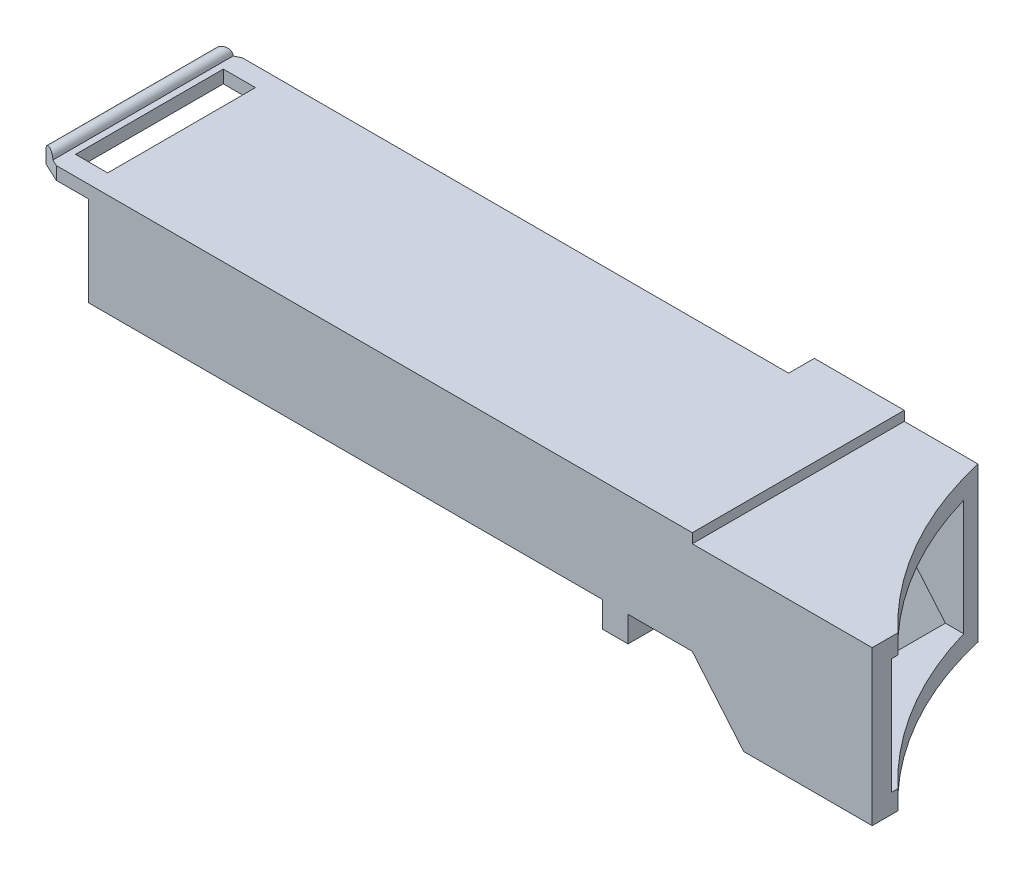
ISO-10303-21;
HEADER;
FILE_DESCRIPTION(('STEP AP214'),'2;1');
FILE_NAME('part.step','',(''),(''),'','','');
FILE_SCHEMA(('AUTOMOTIVE_DESIGN { 1 0 10303 214 1 1 1 1 }'));
ENDSEC;
DATA;
#1=APPLICATION_CONTEXT('core data for automotive mechanical design processes');
#2=APPLICATION_PROTOCOL_DEFINITION('international standard','automotive_design',2000,#1);
#3=PRODUCT_CONTEXT('',#1,'mechanical');
#4=PRODUCT('Part','Part','',(#3));
#5=PRODUCT_RELATED_PRODUCT_CATEGORY('part','',(#4));
#6=PRODUCT_DEFINITION_FORMATION('','',#4);
#7=PRODUCT_DEFINITION_CONTEXT('part definition',#1,'design');
#8=PRODUCT_DEFINITION('design','',#6,#7);
#9=PRODUCT_DEFINITION_SHAPE('','',#8);
#10=(LENGTH_UNIT() NAMED_UNIT(*) SI_UNIT(.MILLI.,.METRE.));
#11=(NAMED_UNIT(*) PLANE_ANGLE_UNIT() SI_UNIT($,.RADIAN.));
#12=(NAMED_UNIT(*) SI_UNIT($,.STERADIAN.) SOLID_ANGLE_UNIT());
#13=UNCERTAINTY_MEASURE_WITH_UNIT(LENGTH_MEASURE(1.E-05),#10,'distance_accuracy_value','');
#14=(GEOMETRIC_REPRESENTATION_CONTEXT(3) GLOBAL_UNCERTAINTY_ASSIGNED_CONTEXT((#13)) GLOBAL_UNIT_ASSIGNED_CONTEXT((#10,
#11,#12)) REPRESENTATION_CONTEXT('',''));
#15=CARTESIAN_POINT('',(0.,0.,0.));
#16=DIRECTION('',(0.,0.,1.));
#17=DIRECTION('',(1.,0.,0.));
#18=AXIS2_PLACEMENT_3D('',#15,#16,#17);
#19=CARTESIAN_POINT('',(70.,-8.,16.5));
#20=DIRECTION('',(0.,1.,0.));
#21=DIRECTION('',(-1.,0.,0.));
#22=AXIS2_PLACEMENT_3D('',#19,#20,#21);
#23=PLANE('',#22);
#24=DIRECTION('',(1.,0.,0.));
#25=VECTOR('',#24,1.);
#26=CARTESIAN_POINT('',(70.,-8.,1.99999999999991));
#27=LINE('',#26,#25);
#28=CARTESIAN_POINT('',(23.,-8.,1.99999999999994));
#29=VERTEX_POINT('',#28);
#30=CARTESIAN_POINT('',(63.,-8.,1.99999999999991));
#31=VERTEX_POINT('',#30);
#32=EDGE_CURVE('E273',#29,#31,#27,.T.);
#33=ORIENTED_EDGE('',*,*,#32,.T.);
#34=DIRECTION('',(0.,0.,-1.));
#35=VECTOR('',#34,1.);
#36=CARTESIAN_POINT('',(63.,-8.,1.99999999999991));
#37=LINE('',#36,#35);
#38=CARTESIAN_POINT('',(63.,-8.,0.));
#39=VERTEX_POINT('',#38);
#40=EDGE_CURVE('E278',#31,#39,#37,.T.);
#41=ORIENTED_EDGE('',*,*,#40,.T.);
#42=DIRECTION('',(1.,0.,0.));
#43=VECTOR('',#42,1.);
#44=CARTESIAN_POINT('',(70.,-8.,0.));
#45=LINE('',#44,#43);
#46=CARTESIAN_POINT('',(70.,-8.,0.));
#47=VERTEX_POINT('',#46);
#48=EDGE_CURVE('E261',#39,#47,#45,.T.);
#49=ORIENTED_EDGE('',*,*,#48,.T.);
#50=DIRECTION('',(0.,0.,-1.));
#51=VECTOR('',#50,1.);
#52=CARTESIAN_POINT('',(70.,-8.,16.5));
#53=LINE('',#52,#51);
#54=CARTESIAN_POINT('',(70.,-8.,16.5));
#55=VERTEX_POINT('',#54);
#56=EDGE_CURVE('E520',#55,#47,#53,.T.);
#57=ORIENTED_EDGE('',*,*,#56,.F.);
#58=DIRECTION('',(1.,0.,0.));
#59=VECTOR('',#58,1.);
#60=CARTESIAN_POINT('',(70.,-8.,16.5));
#61=LINE('',#60,#59);
#62=CARTESIAN_POINT('',(65.,-8.,16.5));
#63=VERTEX_POINT('',#62);
#64=EDGE_CURVE('E482',#63,#55,#61,.T.);
#65=ORIENTED_EDGE('',*,*,#64,.F.);
#66=DIRECTION('',(0.,0.,1.));
#67=VECTOR('',#66,1.);
#68=CARTESIAN_POINT('',(65.,-8.,16.5));
#69=LINE('',#68,#67);
#70=CARTESIAN_POINT('',(65.,-8.,14.5));
#71=VERTEX_POINT('',#70);
#72=EDGE_CURVE('E293',#71,#63,#69,.T.);
#73=ORIENTED_EDGE('',*,*,#72,.F.);
#74=DIRECTION('',(1.,0.,0.));
#75=VECTOR('',#74,1.);
#76=CARTESIAN_POINT('',(63.,-8.,14.5));
#77=LINE('',#76,#75);
#78=CARTESIAN_POINT('',(63.,-8.,14.5));
#79=VERTEX_POINT('',#78);
#80=EDGE_CURVE('E303',#79,#71,#77,.T.);
#81=ORIENTED_EDGE('',*,*,#80,.F.);
#82=DIRECTION('',(0.,0.,-1.));
#83=VECTOR('',#82,1.);
#84=CARTESIAN_POINT('',(63.,-8.,16.5));
#85=LINE('',#84,#83);
#86=CARTESIAN_POINT('',(63.,-8.,16.5));
#87=VERTEX_POINT('',#86);
#88=EDGE_CURVE('E300',#87,#79,#85,.T.);
#89=ORIENTED_EDGE('',*,*,#88,.F.);
#90=CARTESIAN_POINT('',(23.,-8.,16.5));
#91=VERTEX_POINT('',#90);
#92=EDGE_CURVE('E478',#91,#87,#61,.T.);
#93=ORIENTED_EDGE('',*,*,#92,.F.);
#94=DIRECTION('',(0.,0.,-1.));
#95=VECTOR('',#94,1.);
#96=CARTESIAN_POINT('',(23.,-7.99999999999999,16.5));
#97=LINE('',#96,#95);
#98=EDGE_CURVE('E390',#91,#29,#97,.T.);
#99=ORIENTED_EDGE('',*,*,#98,.T.);
#100=EDGE_LOOP('',(#33,#41,#49,#57,#65,#73,#81,#89,#93,#99));
#101=FACE_BOUND('',#100,.T.);
#102=ADVANCED_FACE('F35',(#101),#23,.F.);
#103=CARTESIAN_POINT('',(23.,-21.7721829496753,16.5));
#104=DIRECTION('',(1.,0.,0.));
#105=DIRECTION('',(0.,0.,-1.));
#106=AXIS2_PLACEMENT_3D('',#103,#104,#105);
#107=PLANE('',#106);
#108=DIRECTION('',(0.,0.,-1.));
#109=VECTOR('',#108,1.);
#110=CARTESIAN_POINT('',(23.,-6.5,16.5));
#111=LINE('',#110,#109);
#112=CARTESIAN_POINT('',(23.,-6.5,15.));
#113=VERTEX_POINT('',#112);
#114=CARTESIAN_POINT('',(23.,-6.5,3.49999999999994));
#115=VERTEX_POINT('',#114);
#116=EDGE_CURVE('E382',#113,#115,#111,.T.);
#117=ORIENTED_EDGE('',*,*,#116,.T.);
#118=DIRECTION('',(0.,1.,0.));
#119=VECTOR('',#118,1.);
#120=CARTESIAN_POINT('',(23.,0.,3.49999999999994));
#121=LINE('',#120,#119);
#122=CARTESIAN_POINT('',(23.,-1.5,3.49999999999994));
#123=VERTEX_POINT('',#122);
#124=EDGE_CURVE('E524',#115,#123,#121,.T.);
#125=ORIENTED_EDGE('',*,*,#124,.T.);
#126=DIRECTION('',(0.,0.,1.));
#127=VECTOR('',#126,1.);
#128=CARTESIAN_POINT('',(23.,-1.5,16.5));
#129=LINE('',#128,#127);
#130=CARTESIAN_POINT('',(23.,-1.5,15.));
#131=VERTEX_POINT('',#130);
#132=EDGE_CURVE('E380',#123,#131,#129,.T.);
#133=ORIENTED_EDGE('',*,*,#132,.T.);
#134=DIRECTION('',(0.,1.,0.));
#135=VECTOR('',#134,1.);
#136=CARTESIAN_POINT('',(23.,-10.,15.));
#137=LINE('',#136,#135);
#138=EDGE_CURVE('E384',#113,#131,#137,.T.);
#139=ORIENTED_EDGE('',*,*,#138,.F.);
#140=EDGE_LOOP('',(#117,#125,#133,#139));
#141=FACE_BOUND('',#140,.T.);
#142=DIRECTION('',(0.,0.,1.));
#143=VECTOR('',#142,1.);
#144=CARTESIAN_POINT('',(23.,-1.,-2.27200187265882));
#145=LINE('',#144,#143);
#146=CARTESIAN_POINT('',(23.,-1.,1.99999999999994));
#147=VERTEX_POINT('',#146);
#148=CARTESIAN_POINT('',(23.,-1.,3.49999999999995));
#149=VERTEX_POINT('',#148);
#150=EDGE_CURVE('E365',#147,#149,#145,.T.);
#151=ORIENTED_EDGE('',*,*,#150,.F.);
#152=DIRECTION('',(0.,1.,0.));
#153=VECTOR('',#152,1.);
#154=CARTESIAN_POINT('',(23.,0.,1.99999999999994));
#155=LINE('',#154,#153);
#156=EDGE_CURVE('E387',#29,#147,#155,.T.);
#157=ORIENTED_EDGE('',*,*,#156,.F.);
#158=ORIENTED_EDGE('',*,*,#98,.F.);
#159=DIRECTION('',(0.,-1.,0.));
#160=VECTOR('',#159,1.);
#161=CARTESIAN_POINT('',(23.,-21.7721829496753,16.5));
#162=LINE('',#161,#160);
#163=CARTESIAN_POINT('',(23.,-1.,16.5));
#164=VERTEX_POINT('',#163);
#165=EDGE_CURVE('E364',#164,#91,#162,.T.);
#166=ORIENTED_EDGE('',*,*,#165,.F.);
#167=CARTESIAN_POINT('',(23.,-1.,15.));
#168=VERTEX_POINT('',#167);
#169=EDGE_CURVE('E370',#168,#164,#145,.T.);
#170=ORIENTED_EDGE('',*,*,#169,.F.);
#171=DIRECTION('',(0.,-1.,0.));
#172=VECTOR('',#171,1.);
#173=CARTESIAN_POINT('',(23.,9.,15.));
#174=LINE('',#173,#172);
#175=CARTESIAN_POINT('',(23.,0.,15.));
#176=VERTEX_POINT('',#175);
#177=EDGE_CURVE('E340',#176,#168,#174,.T.);
#178=ORIENTED_EDGE('',*,*,#177,.F.);
#179=DIRECTION('',(0.,0.,1.));
#180=VECTOR('',#179,1.);
#181=CARTESIAN_POINT('',(23.,0.,16.5));
#182=LINE('',#181,#180);
#183=CARTESIAN_POINT('',(23.,0.,3.49999999999995));
#184=VERTEX_POINT('',#183);
#185=EDGE_CURVE('E357',#184,#176,#182,.T.);
#186=ORIENTED_EDGE('',*,*,#185,.F.);
#187=DIRECTION('',(0.,-1.,0.));
#188=VECTOR('',#187,1.);
#189=CARTESIAN_POINT('',(23.,9.,3.49999999999995));
#190=LINE('',#189,#188);
#191=EDGE_CURVE('E341',#184,#149,#190,.T.);
#192=ORIENTED_EDGE('',*,*,#191,.T.);
#193=EDGE_LOOP('',(#151,#157,#158,#166,#170,#178,#186,#192));
#194=FACE_BOUND('',#193,.T.);
#195=ADVANCED_FACE('F628',(#141,#194),#107,.F.);
#196=CARTESIAN_POINT('',(84.,-0.749999999999999,16.5));
#197=DIRECTION('',(-1.,0.,0.));
#198=DIRECTION('',(0.,0.,1.));
#199=AXIS2_PLACEMENT_3D('',#196,#197,#198);
#200=PLANE('',#199);
#201=DIRECTION('',(0.,0.,-1.));
#202=VECTOR('',#201,1.);
#203=CARTESIAN_POINT('',(84.,-12.75,16.5));
#204=LINE('',#203,#202);
#205=CARTESIAN_POINT('',(84.,-12.75,16.5));
#206=VERTEX_POINT('',#205);
#207=CARTESIAN_POINT('',(84.,-12.75,14.5));
#208=VERTEX_POINT('',#207);
#209=EDGE_CURVE('E514',#206,#208,#204,.T.);
#210=ORIENTED_EDGE('',*,*,#209,.T.);
#211=DIRECTION('',(0.,-1.,0.));
#212=VECTOR('',#211,1.);
#213=CARTESIAN_POINT('',(84.,0.,14.5));
#214=LINE('',#213,#212);
#215=CARTESIAN_POINT('',(84.,-11.25,14.5));
#216=VERTEX_POINT('',#215);
#217=EDGE_CURVE('E395',#216,#208,#214,.T.);
#218=ORIENTED_EDGE('',*,*,#217,.F.);
#219=DIRECTION('',(0.,0.,-1.));
#220=VECTOR('',#219,1.);
#221=CARTESIAN_POINT('',(84.,-11.25,16.5));
#222=LINE('',#221,#220);
#223=CARTESIAN_POINT('',(84.,-11.25,15.));
#224=VERTEX_POINT('',#223);
#225=EDGE_CURVE('E443',#224,#216,#222,.T.);
#226=ORIENTED_EDGE('',*,*,#225,.F.);
#227=DIRECTION('',(0.,1.,0.));
#228=VECTOR('',#227,1.);
#229=CARTESIAN_POINT('',(84.,-0.749999999999999,15.));
#230=LINE('',#229,#228);
#231=CARTESIAN_POINT('',(84.,-2.25,15.));
#232=VERTEX_POINT('',#231);
#233=EDGE_CURVE('E416',#224,#232,#230,.T.);
#234=ORIENTED_EDGE('',*,*,#233,.T.);
#235=DIRECTION('',(0.,0.,-1.));
#236=VECTOR('',#235,1.);
#237=CARTESIAN_POINT('',(84.,-2.25,16.5));
#238=LINE('',#237,#236);
#239=CARTESIAN_POINT('',(84.,-2.25,14.5));
#240=VERTEX_POINT('',#239);
#241=EDGE_CURVE('E458',#232,#240,#238,.T.);
#242=ORIENTED_EDGE('',*,*,#241,.T.);
#243=CARTESIAN_POINT('',(84.,-0.749999999999999,14.5));
#244=VERTEX_POINT('',#243);
#245=EDGE_CURVE('E397',#244,#240,#214,.T.);
#246=ORIENTED_EDGE('',*,*,#245,.F.);
#247=DIRECTION('',(0.,0.,-1.));
#248=VECTOR('',#247,1.);
#249=CARTESIAN_POINT('',(84.,-0.749999999999999,16.5));
#250=LINE('',#249,#248);
#251=CARTESIAN_POINT('',(84.,-0.749999999999999,16.5));
#252=VERTEX_POINT('',#251);
#253=EDGE_CURVE('E511',#252,#244,#250,.T.);
#254=ORIENTED_EDGE('',*,*,#253,.F.);
#255=DIRECTION('',(0.,1.,0.));
#256=VECTOR('',#255,1.);
#257=CARTESIAN_POINT('',(84.,-0.749999999999999,16.5));
#258=LINE('',#257,#256);
#259=EDGE_CURVE('E486',#206,#252,#258,.T.);
#260=ORIENTED_EDGE('',*,*,#259,.F.);
#261=EDGE_LOOP('',(#210,#218,#226,#234,#242,#246,#254,#260));
#262=FACE_BOUND('',#261,.T.);
#263=ADVANCED_FACE('F566',(#262),#200,.F.);
#264=CARTESIAN_POINT('',(74.,-12.75,16.5));
#265=DIRECTION('',(0.76491119811705,0.64413574578278,0.));
#266=DIRECTION('',(-0.64413574578278,0.76491119811705,0.));
#267=AXIS2_PLACEMENT_3D('',#264,#265,#266);
#268=PLANE('',#267);
#269=DIRECTION('',(0.64413574578278,-0.76491119811705,0.));
#270=VECTOR('',#269,1.);
#271=CARTESIAN_POINT('',(74.,-12.75,0.));
#272=LINE('',#271,#270);
#273=CARTESIAN_POINT('',(74.,-12.75,0.));
#274=VERTEX_POINT('',#273);
#275=EDGE_CURVE('E268',#47,#274,#272,.T.);
#276=ORIENTED_EDGE('',*,*,#275,.T.);
#277=DIRECTION('',(0.,0.,-1.));
#278=VECTOR('',#277,1.);
#279=CARTESIAN_POINT('',(74.,-12.75,16.5));
#280=LINE('',#279,#278);
#281=CARTESIAN_POINT('',(74.,-12.75,16.5));
#282=VERTEX_POINT('',#281);
#283=EDGE_CURVE('E517',#282,#274,#280,.T.);
#284=ORIENTED_EDGE('',*,*,#283,.F.);
#285=DIRECTION('',(0.64413574578278,-0.76491119811705,0.));
#286=VECTOR('',#285,1.);
#287=CARTESIAN_POINT('',(74.,-12.75,16.5));
#288=LINE('',#287,#286);
#289=EDGE_CURVE('E481',#55,#282,#288,.T.);
#290=ORIENTED_EDGE('',*,*,#289,.F.);
#291=ORIENTED_EDGE('',*,*,#56,.T.);
#292=EDGE_LOOP('',(#276,#284,#290,#291));
#293=FACE_BOUND('',#292,.T.);
#294=ADVANCED_FACE('F607',(#293),#268,.F.);
#295=CARTESIAN_POINT('',(84.,-12.75,16.5));
#296=DIRECTION('',(0.,1.,0.));
#297=DIRECTION('',(0.,0.,1.));
#298=AXIS2_PLACEMENT_3D('',#295,#296,#297);
#299=PLANE('',#298);
#300=DIRECTION('',(1.,0.,0.));
#301=VECTOR('',#300,1.);
#302=CARTESIAN_POINT('',(84.,-12.75,0.));
#303=LINE('',#302,#301);
#304=CARTESIAN_POINT('',(75.7378344778748,-12.75,0.));
#305=VERTEX_POINT('',#304);
#306=EDGE_CURVE('E497',#274,#305,#303,.T.);
#307=ORIENTED_EDGE('',*,*,#306,.T.);
#308=CARTESIAN_POINT('',(104.,-12.75,-6.5));
#309=DIRECTION('',(0.,-1.,0.));
#310=DIRECTION('',(0.,0.,-1.));
#311=AXIS2_PLACEMENT_3D('',#308,#309,#310);
#312=CIRCLE('',#311,29.);
#313=EDGE_CURVE('E392',#208,#305,#312,.T.);
#314=ORIENTED_EDGE('',*,*,#313,.F.);
#315=ORIENTED_EDGE('',*,*,#209,.F.);
#316=DIRECTION('',(1.,0.,0.));
#317=VECTOR('',#316,1.);
#318=CARTESIAN_POINT('',(84.,-12.75,16.5));
#319=LINE('',#318,#317);
#320=EDGE_CURVE('E484',#282,#206,#319,.T.);
#321=ORIENTED_EDGE('',*,*,#320,.F.);
#322=ORIENTED_EDGE('',*,*,#283,.T.);
#323=EDGE_LOOP('',(#307,#314,#315,#321,#322));
#324=FACE_BOUND('',#323,.T.);
#325=ADVANCED_FACE('F602',(#324),#299,.F.);
#326=CARTESIAN_POINT('',(70.,-0.749999999999999,16.5));
#327=DIRECTION('',(0.,-1.,0.));
#328=DIRECTION('',(0.,0.,-1.));
#329=AXIS2_PLACEMENT_3D('',#326,#327,#328);
#330=PLANE('',#329);
#331=ORIENTED_EDGE('',*,*,#253,.T.);
#332=CARTESIAN_POINT('',(104.,-0.749999999999999,-6.5));
#333=DIRECTION('',(0.,-1.,0.));
#334=DIRECTION('',(0.,0.,-1.));
#335=AXIS2_PLACEMENT_3D('',#332,#333,#334);
#336=CIRCLE('',#335,29.);
#337=CARTESIAN_POINT('',(75.7378344778748,-0.749999999999999,0.));
#338=VERTEX_POINT('',#337);
#339=EDGE_CURVE('E404',#244,#338,#336,.T.);
#340=ORIENTED_EDGE('',*,*,#339,.T.);
#341=DIRECTION('',(-1.,0.,0.));
#342=VECTOR('',#341,1.);
#343=CARTESIAN_POINT('',(70.,-0.749999999999999,0.));
#344=LINE('',#343,#342);
#345=CARTESIAN_POINT('',(70.,-0.749999999999999,0.));
#346=VERTEX_POINT('',#345);
#347=EDGE_CURVE('E500',#338,#346,#344,.T.);
#348=ORIENTED_EDGE('',*,*,#347,.T.);
#349=DIRECTION('',(0.,0.,-1.));
#350=VECTOR('',#349,1.);
#351=CARTESIAN_POINT('',(70.,-0.749999999999999,16.5));
#352=LINE('',#351,#350);
#353=CARTESIAN_POINT('',(70.,-0.749999999999999,16.5));
#354=VERTEX_POINT('',#353);
#355=EDGE_CURVE('E508',#354,#346,#352,.T.);
#356=ORIENTED_EDGE('',*,*,#355,.F.);
#357=DIRECTION('',(-1.,0.,0.));
#358=VECTOR('',#357,1.);
#359=CARTESIAN_POINT('',(70.,-0.749999999999999,16.5));
#360=LINE('',#359,#358);
#361=EDGE_CURVE('E488',#252,#354,#360,.T.);
#362=ORIENTED_EDGE('',*,*,#361,.F.);
#363=EDGE_LOOP('',(#331,#340,#348,#356,#362));
#364=FACE_BOUND('',#363,.T.);
#365=ADVANCED_FACE('F559',(#364),#330,.F.);
#366=CARTESIAN_POINT('',(70.,0.,16.5));
#367=DIRECTION('',(-1.,0.,0.));
#368=DIRECTION('',(0.,0.,1.));
#369=AXIS2_PLACEMENT_3D('',#366,#367,#368);
#370=PLANE('',#369);
#371=DIRECTION('',(0.,1.,0.));
#372=VECTOR('',#371,1.);
#373=CARTESIAN_POINT('',(70.,0.,0.));
#374=LINE('',#373,#372);
#375=CARTESIAN_POINT('',(70.,0.,0.));
#376=VERTEX_POINT('',#375);
#377=EDGE_CURVE('E502',#346,#376,#374,.T.);
#378=ORIENTED_EDGE('',*,*,#377,.T.);
#379=DIRECTION('',(0.,0.,-1.));
#380=VECTOR('',#379,1.);
#381=CARTESIAN_POINT('',(70.,0.,16.5));
#382=LINE('',#381,#380);
#383=CARTESIAN_POINT('',(70.,0.,16.5));
#384=VERTEX_POINT('',#383);
#385=EDGE_CURVE('E494',#384,#376,#382,.T.);
#386=ORIENTED_EDGE('',*,*,#385,.F.);
#387=DIRECTION('',(0.,1.,0.));
#388=VECTOR('',#387,1.);
#389=CARTESIAN_POINT('',(70.,0.,16.5));
#390=LINE('',#389,#388);
#391=EDGE_CURVE('E490',#354,#384,#390,.T.);
#392=ORIENTED_EDGE('',*,*,#391,.F.);
#393=ORIENTED_EDGE('',*,*,#355,.T.);
#394=EDGE_LOOP('',(#378,#386,#392,#393));
#395=FACE_BOUND('',#394,.T.);
#396=ADVANCED_FACE('F555',(#395),#370,.F.);
#397=CARTESIAN_POINT('',(9.53089658035289,0.,16.5));
#398=DIRECTION('',(0.,-1.,0.));
#399=DIRECTION('',(0.,0.,-1.));
#400=AXIS2_PLACEMENT_3D('',#397,#398,#399);
#401=PLANE('',#400);
#402=DIRECTION('',(0.,0.,1.));
#403=VECTOR('',#402,1.);
#404=CARTESIAN_POINT('',(63.,0.,1.99999999999991));
#405=LINE('',#404,#403);
#406=CARTESIAN_POINT('',(63.,0.,0.));
#407=VERTEX_POINT('',#406);
#408=CARTESIAN_POINT('',(63.,0.,1.99999999999991));
#409=VERTEX_POINT('',#408);
#410=EDGE_CURVE('E281',#407,#409,#405,.T.);
#411=ORIENTED_EDGE('',*,*,#410,.T.);
#412=DIRECTION('',(-1.,0.,0.));
#413=VECTOR('',#412,1.);
#414=CARTESIAN_POINT('',(63.,0.,1.99999999999991));
#415=LINE('',#414,#413);
#416=CARTESIAN_POINT('',(20.5,0.,1.99999999999995));
#417=VERTEX_POINT('',#416);
#418=EDGE_CURVE('E437',#409,#417,#415,.T.);
#419=ORIENTED_EDGE('',*,*,#418,.T.);
#420=DIRECTION('',(-0.906183139995266,0.,0.422885465331123));
#421=VECTOR('',#420,1.);
#422=CARTESIAN_POINT('',(5.93595522109268,0.,8.79655423015668));
#423=LINE('',#422,#421);
#424=CARTESIAN_POINT('',(20.,0.,2.23333333333328));
#425=VERTEX_POINT('',#424);
#426=EDGE_CURVE('E320',#417,#425,#423,.T.);
#427=ORIENTED_EDGE('',*,*,#426,.T.);
#428=DIRECTION('',(0.,0.,1.));
#429=VECTOR('',#428,1.);
#430=CARTESIAN_POINT('',(20.,0.,-2.27200187265882));
#431=LINE('',#430,#429);
#432=CARTESIAN_POINT('',(20.,0.,16.2666666666667));
#433=VERTEX_POINT('',#432);
#434=EDGE_CURVE('E367',#425,#433,#431,.T.);
#435=ORIENTED_EDGE('',*,*,#434,.T.);
#436=DIRECTION('',(0.906183139995266,0.,0.422885465331123));
#437=VECTOR('',#436,1.);
#438=CARTESIAN_POINT('',(11.4925245641584,0.,12.2965114632739));
#439=LINE('',#438,#437);
#440=CARTESIAN_POINT('',(20.5,0.,16.5));
#441=VERTEX_POINT('',#440);
#442=EDGE_CURVE('E56',#433,#441,#439,.T.);
#443=ORIENTED_EDGE('',*,*,#442,.T.);
#444=DIRECTION('',(-1.,0.,0.));
#445=VECTOR('',#444,1.);
#446=CARTESIAN_POINT('',(9.53089658035289,0.,16.5));
#447=LINE('',#446,#445);
#448=EDGE_CURVE('E492',#384,#441,#447,.T.);
#449=ORIENTED_EDGE('',*,*,#448,.F.);
#450=ORIENTED_EDGE('',*,*,#385,.T.);
#451=DIRECTION('',(-1.,0.,0.));
#452=VECTOR('',#451,1.);
#453=CARTESIAN_POINT('',(9.53089658035289,0.,0.));
#454=LINE('',#453,#452);
#455=EDGE_CURVE('E504',#376,#407,#454,.T.);
#456=ORIENTED_EDGE('',*,*,#455,.T.);
#457=EDGE_LOOP('',(#411,#419,#427,#435,#443,#449,#450,#456));
#458=FACE_BOUND('',#457,.T.);
#459=DIRECTION('',(1.,0.,0.));
#460=VECTOR('',#459,1.);
#461=CARTESIAN_POINT('',(9.53089658035291,0.,3.49999999999993));
#462=LINE('',#461,#460);
#463=CARTESIAN_POINT('',(20.5,0.,3.49999999999995));
#464=VERTEX_POINT('',#463);
#465=EDGE_CURVE('E354',#464,#184,#462,.T.);
#466=ORIENTED_EDGE('',*,*,#465,.T.);
#467=ORIENTED_EDGE('',*,*,#185,.T.);
#468=DIRECTION('',(-1.,0.,0.));
#469=VECTOR('',#468,1.);
#470=CARTESIAN_POINT('',(9.53089658035289,0.,15.));
#471=LINE('',#470,#469);
#472=CARTESIAN_POINT('',(20.5,0.,15.));
#473=VERTEX_POINT('',#472);
#474=EDGE_CURVE('E343',#176,#473,#471,.T.);
#475=ORIENTED_EDGE('',*,*,#474,.T.);
#476=DIRECTION('',(0.,0.,-1.));
#477=VECTOR('',#476,1.);
#478=CARTESIAN_POINT('',(20.5,0.,16.5));
#479=LINE('',#478,#477);
#480=EDGE_CURVE('E351',#473,#464,#479,.T.);
#481=ORIENTED_EDGE('',*,*,#480,.T.);
#482=EDGE_LOOP('',(#466,#467,#475,#481));
#483=FACE_BOUND('',#482,.T.);
#484=ADVANCED_FACE('F533',(#458,#483),#401,.F.);
#485=CARTESIAN_POINT('',(9.53089658035289,-10.,16.5));
#486=DIRECTION('',(0.,0.,1.));
#487=DIRECTION('',(1.,0.,0.));
#488=AXIS2_PLACEMENT_3D('',#485,#486,#487);
#489=PLANE('',#488);
#490=DIRECTION('',(0.,-1.,0.));
#491=VECTOR('',#490,1.);
#492=CARTESIAN_POINT('',(20.5,9.,16.5));
#493=LINE('',#492,#491);
#494=CARTESIAN_POINT('',(20.5,-1.,16.5));
#495=VERTEX_POINT('',#494);
#496=EDGE_CURVE('E316',#441,#495,#493,.T.);
#497=ORIENTED_EDGE('',*,*,#496,.T.);
#498=DIRECTION('',(1.,0.,0.));
#499=VECTOR('',#498,1.);
#500=CARTESIAN_POINT('',(19.,-1.,16.5));
#501=LINE('',#500,#499);
#502=EDGE_CURVE('E360',#495,#164,#501,.T.);
#503=ORIENTED_EDGE('',*,*,#502,.T.);
#504=ORIENTED_EDGE('',*,*,#165,.T.);
#505=ORIENTED_EDGE('',*,*,#92,.T.);
#506=DIRECTION('',(0.,1.,0.));
#507=VECTOR('',#506,1.);
#508=CARTESIAN_POINT('',(63.,-10.,16.5));
#509=LINE('',#508,#507);
#510=CARTESIAN_POINT('',(63.,-10.,16.5));
#511=VERTEX_POINT('',#510);
#512=EDGE_CURVE('E299',#511,#87,#509,.T.);
#513=ORIENTED_EDGE('',*,*,#512,.F.);
#514=DIRECTION('',(-1.,0.,0.));
#515=VECTOR('',#514,1.);
#516=CARTESIAN_POINT('',(63.,-10.,16.5));
#517=LINE('',#516,#515);
#518=CARTESIAN_POINT('',(65.,-10.,16.5));
#519=VERTEX_POINT('',#518);
#520=EDGE_CURVE('E297',#519,#511,#517,.T.);
#521=ORIENTED_EDGE('',*,*,#520,.F.);
#522=DIRECTION('',(0.,1.,0.));
#523=VECTOR('',#522,1.);
#524=CARTESIAN_POINT('',(65.,-10.,16.5));
#525=LINE('',#524,#523);
#526=EDGE_CURVE('E49',#519,#63,#525,.T.);
#527=ORIENTED_EDGE('',*,*,#526,.T.);
#528=ORIENTED_EDGE('',*,*,#64,.T.);
#529=ORIENTED_EDGE('',*,*,#289,.T.);
#530=ORIENTED_EDGE('',*,*,#320,.T.);
#531=ORIENTED_EDGE('',*,*,#259,.T.);
#532=ORIENTED_EDGE('',*,*,#361,.T.);
#533=ORIENTED_EDGE('',*,*,#391,.T.);
#534=ORIENTED_EDGE('',*,*,#448,.T.);
#535=EDGE_LOOP('',(#497,#503,#504,#505,#513,#521,#527,#528,#529,#530,#531,#532,#533,#534));
#536=FACE_BOUND('',#535,.T.);
#537=ADVANCED_FACE('F549',(#536),#489,.T.);
#538=CARTESIAN_POINT('',(9.53089658035289,-10.,0.));
#539=DIRECTION('',(0.,0.,1.));
#540=DIRECTION('',(1.,0.,0.));
#541=AXIS2_PLACEMENT_3D('',#538,#539,#540);
#542=PLANE('',#541);
#543=ORIENTED_EDGE('',*,*,#347,.F.);
#544=DIRECTION('',(0.,-1.,0.));
#545=VECTOR('',#544,1.);
#546=CARTESIAN_POINT('',(75.7378344778748,0.,0.));
#547=LINE('',#546,#545);
#548=EDGE_CURVE('E394',#338,#305,#547,.T.);
#549=ORIENTED_EDGE('',*,*,#548,.T.);
#550=ORIENTED_EDGE('',*,*,#306,.F.);
#551=ORIENTED_EDGE('',*,*,#275,.F.);
#552=ORIENTED_EDGE('',*,*,#48,.F.);
#553=DIRECTION('',(0.,-1.,0.));
#554=VECTOR('',#553,1.);
#555=CARTESIAN_POINT('',(63.,2.82842712474617,0.));
#556=LINE('',#555,#554);
#557=EDGE_CURVE('E266',#407,#39,#556,.T.);
#558=ORIENTED_EDGE('',*,*,#557,.F.);
#559=ORIENTED_EDGE('',*,*,#455,.F.);
#560=ORIENTED_EDGE('',*,*,#377,.F.);
#561=EDGE_LOOP('',(#543,#549,#550,#551,#552,#558,#559,#560));
#562=FACE_BOUND('',#561,.T.);
#563=ADVANCED_FACE('F264',(#562),#542,.F.);
#564=CARTESIAN_POINT('',(63.,0.,1.99999999999991));
#565=DIRECTION('',(0.,0.,1.));
#566=DIRECTION('',(1.,0.,0.));
#567=AXIS2_PLACEMENT_3D('',#564,#565,#566);
#568=PLANE('',#567);
#569=DIRECTION('',(-1.,0.,0.));
#570=VECTOR('',#569,1.);
#571=CARTESIAN_POINT('',(19.,-1.,1.99999999999995));
#572=LINE('',#571,#570);
#573=CARTESIAN_POINT('',(20.5,-1.,1.99999999999995));
#574=VERTEX_POINT('',#573);
#575=EDGE_CURVE('E361',#147,#574,#572,.T.);
#576=ORIENTED_EDGE('',*,*,#575,.T.);
#577=DIRECTION('',(0.,-1.,0.));
#578=VECTOR('',#577,1.);
#579=CARTESIAN_POINT('',(20.5,9.,1.99999999999995));
#580=LINE('',#579,#578);
#581=EDGE_CURVE('E324',#417,#574,#580,.T.);
#582=ORIENTED_EDGE('',*,*,#581,.F.);
#583=ORIENTED_EDGE('',*,*,#418,.F.);
#584=DIRECTION('',(0.,-1.,0.));
#585=VECTOR('',#584,1.);
#586=CARTESIAN_POINT('',(63.,0.,1.99999999999991));
#587=LINE('',#586,#585);
#588=EDGE_CURVE('E475',#409,#31,#587,.T.);
#589=ORIENTED_EDGE('',*,*,#588,.T.);
#590=ORIENTED_EDGE('',*,*,#32,.F.);
#591=ORIENTED_EDGE('',*,*,#156,.T.);
#592=EDGE_LOOP('',(#576,#582,#583,#589,#590,#591));
#593=FACE_BOUND('',#592,.T.);
#594=ADVANCED_FACE('F630',(#593),#568,.F.);
#595=CARTESIAN_POINT('',(70.,-6.5,16.5));
#596=DIRECTION('',(0.,1.,0.));
#597=DIRECTION('',(-1.,0.,0.));
#598=AXIS2_PLACEMENT_3D('',#595,#596,#597);
#599=PLANE('',#598);
#600=ORIENTED_EDGE('',*,*,#116,.F.);
#601=DIRECTION('',(1.,0.,0.));
#602=VECTOR('',#601,1.);
#603=CARTESIAN_POINT('',(70.,-6.5,15.));
#604=LINE('',#603,#602);
#605=CARTESIAN_POINT('',(70.6978540550064,-6.5,15.));
#606=VERTEX_POINT('',#605);
#607=EDGE_CURVE('E408',#113,#606,#604,.T.);
#608=ORIENTED_EDGE('',*,*,#607,.T.);
#609=DIRECTION('',(0.,0.,-1.));
#610=VECTOR('',#609,1.);
#611=CARTESIAN_POINT('',(70.6978540550064,-6.5,16.5));
#612=LINE('',#611,#610);
#613=CARTESIAN_POINT('',(70.6978540550064,-6.5,1.5));
#614=VERTEX_POINT('',#613);
#615=EDGE_CURVE('E434',#606,#614,#612,.T.);
#616=ORIENTED_EDGE('',*,*,#615,.T.);
#617=DIRECTION('',(1.,0.,0.));
#618=VECTOR('',#617,1.);
#619=CARTESIAN_POINT('',(70.,-6.5,1.5));
#620=LINE('',#619,#618);
#621=CARTESIAN_POINT('',(65.6213203435596,-6.5,1.5));
#622=VERTEX_POINT('',#621);
#623=EDGE_CURVE('E427',#622,#614,#620,.T.);
#624=ORIENTED_EDGE('',*,*,#623,.F.);
#625=DIRECTION('',(0.707106781186552,0.,-0.707106781186543));
#626=VECTOR('',#625,1.);
#627=CARTESIAN_POINT('',(60.3106601717798,-6.5,6.81066017177969));
#628=LINE('',#627,#626);
#629=CARTESIAN_POINT('',(63.6213203435596,-6.5,3.49999999999991));
#630=VERTEX_POINT('',#629);
#631=EDGE_CURVE('E428',#630,#622,#628,.T.);
#632=ORIENTED_EDGE('',*,*,#631,.F.);
#633=DIRECTION('',(1.,0.,0.));
#634=VECTOR('',#633,1.);
#635=CARTESIAN_POINT('',(70.,-6.5,3.49999999999991));
#636=LINE('',#635,#634);
#637=EDGE_CURVE('E425',#115,#630,#636,.T.);
#638=ORIENTED_EDGE('',*,*,#637,.F.);
#639=EDGE_LOOP('',(#600,#608,#616,#624,#632,#638));
#640=FACE_BOUND('',#639,.T.);
#641=ADVANCED_FACE('F669',(#640),#599,.T.);
#642=CARTESIAN_POINT('',(75.1473667971756,-11.7837963813258,16.5));
#643=DIRECTION('',(0.76491119811705,0.64413574578278,0.));
#644=DIRECTION('',(-0.64413574578278,0.76491119811705,0.));
#645=AXIS2_PLACEMENT_3D('',#642,#643,#644);
#646=PLANE('',#645);
#647=DIRECTION('',(0.64413574578278,-0.76491119811705,0.));
#648=VECTOR('',#647,1.);
#649=CARTESIAN_POINT('',(75.1473667971756,-11.7837963813258,1.5));
#650=LINE('',#649,#648);
#651=CARTESIAN_POINT('',(74.6978540550064,-11.25,1.5));
#652=VERTEX_POINT('',#651);
#653=EDGE_CURVE('E433',#614,#652,#650,.T.);
#654=ORIENTED_EDGE('',*,*,#653,.F.);
#655=ORIENTED_EDGE('',*,*,#615,.F.);
#656=DIRECTION('',(0.64413574578278,-0.76491119811705,0.));
#657=VECTOR('',#656,1.);
#658=CARTESIAN_POINT('',(75.1473667971756,-11.7837963813258,15.));
#659=LINE('',#658,#657);
#660=CARTESIAN_POINT('',(74.6978540550064,-11.25,15.));
#661=VERTEX_POINT('',#660);
#662=EDGE_CURVE('E410',#606,#661,#659,.T.);
#663=ORIENTED_EDGE('',*,*,#662,.T.);
#664=DIRECTION('',(0.,0.,-1.));
#665=VECTOR('',#664,1.);
#666=CARTESIAN_POINT('',(74.6978540550064,-11.25,16.5));
#667=LINE('',#666,#665);
#668=EDGE_CURVE('E438',#661,#652,#667,.T.);
#669=ORIENTED_EDGE('',*,*,#668,.T.);
#670=EDGE_LOOP('',(#654,#655,#663,#669));
#671=FACE_BOUND('',#670,.T.);
#672=ADVANCED_FACE('F672',(#671),#646,.T.);
#673=CARTESIAN_POINT('',(84.,-11.25,16.5));
#674=DIRECTION('',(0.,1.,0.));
#675=DIRECTION('',(0.,0.,1.));
#676=AXIS2_PLACEMENT_3D('',#673,#674,#675);
#677=PLANE('',#676);
#678=CARTESIAN_POINT('',(104.,-11.25,-6.5));
#679=DIRECTION('',(0.,1.,0.));
#680=DIRECTION('',(0.,0.,1.));
#681=AXIS2_PLACEMENT_3D('',#678,#679,#680);
#682=CIRCLE('',#681,29.);
#683=CARTESIAN_POINT('',(76.1252802704673,-11.25,1.5));
#684=VERTEX_POINT('',#683);
#685=EDGE_CURVE('E402',#684,#216,#682,.T.);
#686=ORIENTED_EDGE('',*,*,#685,.F.);
#687=DIRECTION('',(1.,0.,0.));
#688=VECTOR('',#687,1.);
#689=CARTESIAN_POINT('',(84.,-11.25,1.5));
#690=LINE('',#689,#688);
#691=EDGE_CURVE('E440',#652,#684,#690,.T.);
#692=ORIENTED_EDGE('',*,*,#691,.F.);
#693=ORIENTED_EDGE('',*,*,#668,.F.);
#694=DIRECTION('',(1.,0.,0.));
#695=VECTOR('',#694,1.);
#696=CARTESIAN_POINT('',(84.,-11.25,15.));
#697=LINE('',#696,#695);
#698=EDGE_CURVE('E413',#661,#224,#697,.T.);
#699=ORIENTED_EDGE('',*,*,#698,.T.);
#700=ORIENTED_EDGE('',*,*,#225,.T.);
#701=EDGE_LOOP('',(#686,#692,#693,#699,#700));
#702=FACE_BOUND('',#701,.T.);
#703=ADVANCED_FACE('F597',(#702),#677,.T.);
#704=CARTESIAN_POINT('',(70.,-2.25,16.5));
#705=DIRECTION('',(0.,-1.,0.));
#706=DIRECTION('',(0.,0.,-1.));
#707=AXIS2_PLACEMENT_3D('',#704,#705,#706);
#708=PLANE('',#707);
#709=CARTESIAN_POINT('',(104.,-2.25,-6.5));
#710=DIRECTION('',(0.,-1.,0.));
#711=DIRECTION('',(0.,0.,-1.));
#712=AXIS2_PLACEMENT_3D('',#709,#710,#711);
#713=CIRCLE('',#712,29.);
#714=CARTESIAN_POINT('',(76.1252802704673,-2.25,1.5));
#715=VERTEX_POINT('',#714);
#716=EDGE_CURVE('E400',#240,#715,#713,.T.);
#717=ORIENTED_EDGE('',*,*,#716,.F.);
#718=ORIENTED_EDGE('',*,*,#241,.F.);
#719=DIRECTION('',(-1.,0.,0.));
#720=VECTOR('',#719,1.);
#721=CARTESIAN_POINT('',(70.,-2.25,15.));
#722=LINE('',#721,#720);
#723=CARTESIAN_POINT('',(68.5,-2.25,15.));
#724=VERTEX_POINT('',#723);
#725=EDGE_CURVE('E417',#232,#724,#722,.T.);
#726=ORIENTED_EDGE('',*,*,#725,.T.);
#727=DIRECTION('',(0.,0.,-1.));
#728=VECTOR('',#727,1.);
#729=CARTESIAN_POINT('',(68.5,-2.25,16.5));
#730=LINE('',#729,#728);
#731=CARTESIAN_POINT('',(68.5,-2.25,1.5));
#732=VERTEX_POINT('',#731);
#733=EDGE_CURVE('E455',#724,#732,#730,.T.);
#734=ORIENTED_EDGE('',*,*,#733,.T.);
#735=DIRECTION('',(-1.,0.,0.));
#736=VECTOR('',#735,1.);
#737=CARTESIAN_POINT('',(70.,-2.25,1.5));
#738=LINE('',#737,#736);
#739=EDGE_CURVE('E446',#715,#732,#738,.T.);
#740=ORIENTED_EDGE('',*,*,#739,.F.);
#741=EDGE_LOOP('',(#717,#718,#726,#734,#740));
#742=FACE_BOUND('',#741,.T.);
#743=ADVANCED_FACE('F571',(#742),#708,.T.);
#744=CARTESIAN_POINT('',(68.5,0.,16.5));
#745=DIRECTION('',(-1.,0.,0.));
#746=DIRECTION('',(0.,0.,1.));
#747=AXIS2_PLACEMENT_3D('',#744,#745,#746);
#748=PLANE('',#747);
#749=DIRECTION('',(0.,1.,0.));
#750=VECTOR('',#749,1.);
#751=CARTESIAN_POINT('',(68.5,0.,1.5));
#752=LINE('',#751,#750);
#753=CARTESIAN_POINT('',(68.5,-1.5,1.5));
#754=VERTEX_POINT('',#753);
#755=EDGE_CURVE('E452',#732,#754,#752,.T.);
#756=ORIENTED_EDGE('',*,*,#755,.F.);
#757=ORIENTED_EDGE('',*,*,#733,.F.);
#758=DIRECTION('',(0.,1.,0.));
#759=VECTOR('',#758,1.);
#760=CARTESIAN_POINT('',(68.5,0.,15.));
#761=LINE('',#760,#759);
#762=CARTESIAN_POINT('',(68.5,-1.5,15.));
#763=VERTEX_POINT('',#762);
#764=EDGE_CURVE('E419',#724,#763,#761,.T.);
#765=ORIENTED_EDGE('',*,*,#764,.T.);
#766=DIRECTION('',(0.,0.,-1.));
#767=VECTOR('',#766,1.);
#768=CARTESIAN_POINT('',(68.5,-1.5,16.5));
#769=LINE('',#768,#767);
#770=EDGE_CURVE('E424',#763,#754,#769,.T.);
#771=ORIENTED_EDGE('',*,*,#770,.T.);
#772=EDGE_LOOP('',(#756,#757,#765,#771));
#773=FACE_BOUND('',#772,.T.);
#774=ADVANCED_FACE('F583',(#773),#748,.T.);
#775=CARTESIAN_POINT('',(9.53089658035289,-1.5,16.5));
#776=DIRECTION('',(0.,-1.,0.));
#777=DIRECTION('',(0.,0.,-1.));
#778=AXIS2_PLACEMENT_3D('',#775,#776,#777);
#779=PLANE('',#778);
#780=ORIENTED_EDGE('',*,*,#132,.F.);
#781=DIRECTION('',(-1.,0.,0.));
#782=VECTOR('',#781,1.);
#783=CARTESIAN_POINT('',(9.53089658035288,-1.5,3.49999999999996));
#784=LINE('',#783,#782);
#785=CARTESIAN_POINT('',(63.6213203435596,-1.5,3.49999999999991));
#786=VERTEX_POINT('',#785);
#787=EDGE_CURVE('E449',#786,#123,#784,.T.);
#788=ORIENTED_EDGE('',*,*,#787,.F.);
#789=DIRECTION('',(-0.707106781186552,0.,0.707106781186543));
#790=VECTOR('',#789,1.);
#791=CARTESIAN_POINT('',(30.0761084619559,-1.5,37.0452118816032));
#792=LINE('',#791,#790);
#793=CARTESIAN_POINT('',(65.6213203435596,-1.5,1.5));
#794=VERTEX_POINT('',#793);
#795=EDGE_CURVE('E407',#794,#786,#792,.T.);
#796=ORIENTED_EDGE('',*,*,#795,.F.);
#797=DIRECTION('',(-1.,0.,0.));
#798=VECTOR('',#797,1.);
#799=CARTESIAN_POINT('',(9.53089658035289,-1.5,1.5));
#800=LINE('',#799,#798);
#801=EDGE_CURVE('E411',#754,#794,#800,.T.);
#802=ORIENTED_EDGE('',*,*,#801,.F.);
#803=ORIENTED_EDGE('',*,*,#770,.F.);
#804=DIRECTION('',(-1.,0.,0.));
#805=VECTOR('',#804,1.);
#806=CARTESIAN_POINT('',(9.53089658035289,-1.5,15.));
#807=LINE('',#806,#805);
#808=EDGE_CURVE('E421',#763,#131,#807,.T.);
#809=ORIENTED_EDGE('',*,*,#808,.T.);
#810=EDGE_LOOP('',(#780,#788,#796,#802,#803,#809));
#811=FACE_BOUND('',#810,.T.);
#812=ADVANCED_FACE('F587',(#811),#779,.T.);
#813=CARTESIAN_POINT('',(9.53089658035289,-10.,15.));
#814=DIRECTION('',(0.,0.,1.));
#815=DIRECTION('',(1.,0.,0.));
#816=AXIS2_PLACEMENT_3D('',#813,#814,#815);
#817=PLANE('',#816);
#818=ORIENTED_EDGE('',*,*,#607,.F.);
#819=ORIENTED_EDGE('',*,*,#138,.T.);
#820=ORIENTED_EDGE('',*,*,#808,.F.);
#821=ORIENTED_EDGE('',*,*,#764,.F.);
#822=ORIENTED_EDGE('',*,*,#725,.F.);
#823=ORIENTED_EDGE('',*,*,#233,.F.);
#824=ORIENTED_EDGE('',*,*,#698,.F.);
#825=ORIENTED_EDGE('',*,*,#662,.F.);
#826=EDGE_LOOP('',(#818,#819,#820,#821,#822,#823,#824,#825));
#827=FACE_BOUND('',#826,.T.);
#828=ADVANCED_FACE('F577',(#827),#817,.F.);
#829=CARTESIAN_POINT('',(9.53089658035289,-10.,1.5));
#830=DIRECTION('',(0.,0.,1.));
#831=DIRECTION('',(1.,0.,0.));
#832=AXIS2_PLACEMENT_3D('',#829,#830,#831);
#833=PLANE('',#832);
#834=DIRECTION('',(0.,-1.,0.));
#835=VECTOR('',#834,1.);
#836=CARTESIAN_POINT('',(76.1252802704673,0.,1.5));
#837=LINE('',#836,#835);
#838=EDGE_CURVE('E522',#715,#684,#837,.T.);
#839=ORIENTED_EDGE('',*,*,#838,.F.);
#840=ORIENTED_EDGE('',*,*,#739,.T.);
#841=ORIENTED_EDGE('',*,*,#755,.T.);
#842=ORIENTED_EDGE('',*,*,#801,.T.);
#843=DIRECTION('',(0.,-1.,0.));
#844=VECTOR('',#843,1.);
#845=CARTESIAN_POINT('',(65.6213203435596,0.,1.5));
#846=LINE('',#845,#844);
#847=EDGE_CURVE('E447',#794,#622,#846,.T.);
#848=ORIENTED_EDGE('',*,*,#847,.T.);
#849=ORIENTED_EDGE('',*,*,#623,.T.);
#850=ORIENTED_EDGE('',*,*,#653,.T.);
#851=ORIENTED_EDGE('',*,*,#691,.T.);
#852=EDGE_LOOP('',(#839,#840,#841,#842,#848,#849,#850,#851));
#853=FACE_BOUND('',#852,.T.);
#854=ADVANCED_FACE('F592',(#853),#833,.T.);
#855=CARTESIAN_POINT('',(63.,0.,3.49999999999991));
#856=DIRECTION('',(0.,0.,1.));
#857=DIRECTION('',(1.,0.,0.));
#858=AXIS2_PLACEMENT_3D('',#855,#856,#857);
#859=PLANE('',#858);
#860=ORIENTED_EDGE('',*,*,#124,.F.);
#861=ORIENTED_EDGE('',*,*,#637,.T.);
#862=DIRECTION('',(0.,-1.,0.));
#863=VECTOR('',#862,1.);
#864=CARTESIAN_POINT('',(63.6213203435596,0.,3.49999999999991));
#865=LINE('',#864,#863);
#866=EDGE_CURVE('E431',#786,#630,#865,.T.);
#867=ORIENTED_EDGE('',*,*,#866,.F.);
#868=ORIENTED_EDGE('',*,*,#787,.T.);
#869=EDGE_LOOP('',(#860,#861,#867,#868));
#870=FACE_BOUND('',#869,.T.);
#871=ADVANCED_FACE('F689',(#870),#859,.T.);
#872=CARTESIAN_POINT('',(66.0606601717798,0.,1.06066017177976));
#873=DIRECTION('',(0.707106781186543,0.,0.707106781186552));
#874=DIRECTION('',(0.707106781186552,0.,-0.707106781186543));
#875=AXIS2_PLACEMENT_3D('',#872,#873,#874);
#876=PLANE('',#875);
#877=ORIENTED_EDGE('',*,*,#866,.T.);
#878=ORIENTED_EDGE('',*,*,#631,.T.);
#879=ORIENTED_EDGE('',*,*,#847,.F.);
#880=ORIENTED_EDGE('',*,*,#795,.T.);
#881=EDGE_LOOP('',(#877,#878,#879,#880));
#882=FACE_BOUND('',#881,.T.);
#883=ADVANCED_FACE('F668',(#882),#876,.T.);
#884=CARTESIAN_POINT('',(104.,0.,-6.5));
#885=DIRECTION('',(0.,-1.,0.));
#886=DIRECTION('',(0.,0.,-1.));
#887=AXIS2_PLACEMENT_3D('',#884,#885,#886);
#888=CYLINDRICAL_SURFACE('',#887,29.);
#889=ORIENTED_EDGE('',*,*,#245,.T.);
#890=ORIENTED_EDGE('',*,*,#716,.T.);
#891=ORIENTED_EDGE('',*,*,#838,.T.);
#892=ORIENTED_EDGE('',*,*,#685,.T.);
#893=ORIENTED_EDGE('',*,*,#217,.T.);
#894=ORIENTED_EDGE('',*,*,#313,.T.);
#895=ORIENTED_EDGE('',*,*,#548,.F.);
#896=ORIENTED_EDGE('',*,*,#339,.F.);
#897=EDGE_LOOP('',(#889,#890,#891,#892,#893,#894,#895,#896));
#898=FACE_BOUND('',#897,.T.);
#899=ADVANCED_FACE('F563',(#898),#888,.F.);
#900=CARTESIAN_POINT('',(19.,-1.,-2.27200187265882));
#901=DIRECTION('',(0.,-1.,0.));
#902=DIRECTION('',(0.,0.,-1.));
#903=AXIS2_PLACEMENT_3D('',#900,#901,#902);
#904=PLANE('',#903);
#905=DIRECTION('',(0.906183139995266,0.,0.422885465331123));
#906=VECTOR('',#905,1.);
#907=CARTESIAN_POINT('',(19.,-1.,15.8));
#908=LINE('',#907,#906);
#909=CARTESIAN_POINT('',(19.,-1.,15.8));
#910=VERTEX_POINT('',#909);
#911=EDGE_CURVE('E314',#910,#495,#908,.T.);
#912=ORIENTED_EDGE('',*,*,#911,.F.);
#913=DIRECTION('',(0.,0.,1.));
#914=VECTOR('',#913,1.);
#915=CARTESIAN_POINT('',(19.,-1.,-2.27200187265882));
#916=LINE('',#915,#914);
#917=CARTESIAN_POINT('',(19.,-1.,2.69999999999995));
#918=VERTEX_POINT('',#917);
#919=EDGE_CURVE('E371',#918,#910,#916,.T.);
#920=ORIENTED_EDGE('',*,*,#919,.F.);
#921=DIRECTION('',(-0.906183139995266,0.,0.422885465331123));
#922=VECTOR('',#921,1.);
#923=CARTESIAN_POINT('',(19.,-1.,2.69999999999995));
#924=LINE('',#923,#922);
#925=EDGE_CURVE('E313',#574,#918,#924,.T.);
#926=ORIENTED_EDGE('',*,*,#925,.F.);
#927=ORIENTED_EDGE('',*,*,#575,.F.);
#928=ORIENTED_EDGE('',*,*,#150,.T.);
#929=DIRECTION('',(1.,0.,0.));
#930=VECTOR('',#929,1.);
#931=CARTESIAN_POINT('',(23.,-1.,3.49999999999995));
#932=LINE('',#931,#930);
#933=CARTESIAN_POINT('',(20.5,-1.,3.49999999999995));
#934=VERTEX_POINT('',#933);
#935=EDGE_CURVE('E337',#934,#149,#932,.T.);
#936=ORIENTED_EDGE('',*,*,#935,.F.);
#937=DIRECTION('',(0.,0.,-1.));
#938=VECTOR('',#937,1.);
#939=CARTESIAN_POINT('',(20.5,-1.,3.49999999999995));
#940=LINE('',#939,#938);
#941=CARTESIAN_POINT('',(20.5,-1.,15.));
#942=VERTEX_POINT('',#941);
#943=EDGE_CURVE('E334',#942,#934,#940,.T.);
#944=ORIENTED_EDGE('',*,*,#943,.F.);
#945=DIRECTION('',(-1.,0.,0.));
#946=VECTOR('',#945,1.);
#947=CARTESIAN_POINT('',(23.,-1.,15.));
#948=LINE('',#947,#946);
#949=EDGE_CURVE('E331',#168,#942,#948,.T.);
#950=ORIENTED_EDGE('',*,*,#949,.F.);
#951=ORIENTED_EDGE('',*,*,#169,.T.);
#952=ORIENTED_EDGE('',*,*,#502,.F.);
#953=EDGE_LOOP('',(#912,#920,#926,#927,#928,#936,#944,#950,#951,#952));
#954=FACE_BOUND('',#953,.T.);
#955=ADVANCED_FACE('F545',(#954),#904,.T.);
#956=CARTESIAN_POINT('',(19.,0.,-2.27200187265882));
#957=DIRECTION('',(-1.,0.,0.));
#958=DIRECTION('',(0.,0.,1.));
#959=AXIS2_PLACEMENT_3D('',#956,#957,#958);
#960=PLANE('',#959);
#961=DIRECTION('',(0.,-1.,0.));
#962=VECTOR('',#961,1.);
#963=CARTESIAN_POINT('',(19.,9.,15.8));
#964=LINE('',#963,#962);
#965=CARTESIAN_POINT('',(19.,0.,15.8));
#966=VERTEX_POINT('',#965);
#967=EDGE_CURVE('E318',#966,#910,#964,.T.);
#968=ORIENTED_EDGE('',*,*,#967,.F.);
#969=DIRECTION('',(0.,0.,1.));
#970=VECTOR('',#969,1.);
#971=CARTESIAN_POINT('',(19.,0.,-2.27200187265882));
#972=LINE('',#971,#970);
#973=CARTESIAN_POINT('',(19.,0.,2.69999999999995));
#974=VERTEX_POINT('',#973);
#975=EDGE_CURVE('E374',#974,#966,#972,.T.);
#976=ORIENTED_EDGE('',*,*,#975,.F.);
#977=DIRECTION('',(0.,-1.,0.));
#978=VECTOR('',#977,1.);
#979=CARTESIAN_POINT('',(19.,9.,2.69999999999995));
#980=LINE('',#979,#978);
#981=EDGE_CURVE('E317',#974,#918,#980,.T.);
#982=ORIENTED_EDGE('',*,*,#981,.T.);
#983=ORIENTED_EDGE('',*,*,#919,.T.);
#984=EDGE_LOOP('',(#968,#976,#982,#983));
#985=FACE_BOUND('',#984,.T.);
#986=ADVANCED_FACE('F541',(#985),#960,.T.);
#987=CARTESIAN_POINT('',(19.5,0.,-2.27200187265882));
#988=DIRECTION('',(0.,0.,1.));
#989=DIRECTION('',(1.,0.,0.));
#990=AXIS2_PLACEMENT_3D('',#987,#988,#989);
#991=CYLINDRICAL_SURFACE('',#990,0.5);
#992=CARTESIAN_POINT('',(19.5,0.,16.0333333333333));
#993=DIRECTION('',(0.422885465331123,0.,-0.906183139995266));
#994=DIRECTION('',(0.906183139995266,0.,0.422885465331123));
#995=AXIS2_PLACEMENT_3D('',#992,#993,#994);
#996=ELLIPSE('',#995,0.551764845241562,0.5);
#997=EDGE_CURVE('E11',#433,#966,#996,.F.);
#998=ORIENTED_EDGE('',*,*,#997,.F.);
#999=ORIENTED_EDGE('',*,*,#434,.F.);
#1000=CARTESIAN_POINT('',(19.5,0.,2.46666666666661));
#1001=DIRECTION('',(0.422885465331123,0.,0.906183139995266));
#1002=DIRECTION('',(-0.906183139995266,0.,0.422885465331123));
#1003=AXIS2_PLACEMENT_3D('',#1000,#1001,#1002);
#1004=ELLIPSE('',#1003,0.551764845241562,0.5);
#1005=EDGE_CURVE('E42',#974,#425,#1004,.F.);
#1006=ORIENTED_EDGE('',*,*,#1005,.F.);
#1007=ORIENTED_EDGE('',*,*,#975,.T.);
#1008=EDGE_LOOP('',(#998,#999,#1006,#1007));
#1009=FACE_BOUND('',#1008,.T.);
#1010=ADVANCED_FACE('F536',(#1009),#991,.T.);
#1011=CARTESIAN_POINT('',(23.,9.,3.49999999999995));
#1012=DIRECTION('',(0.,0.,-1.));
#1013=DIRECTION('',(-1.,0.,0.));
#1014=AXIS2_PLACEMENT_3D('',#1011,#1012,#1013);
#1015=PLANE('',#1014);
#1016=DIRECTION('',(0.,-1.,0.));
#1017=VECTOR('',#1016,1.);
#1018=CARTESIAN_POINT('',(20.5,9.,3.49999999999995));
#1019=LINE('',#1018,#1017);
#1020=EDGE_CURVE('E344',#464,#934,#1019,.T.);
#1021=ORIENTED_EDGE('',*,*,#1020,.T.);
#1022=ORIENTED_EDGE('',*,*,#935,.T.);
#1023=ORIENTED_EDGE('',*,*,#191,.F.);
#1024=ORIENTED_EDGE('',*,*,#465,.F.);
#1025=EDGE_LOOP('',(#1021,#1022,#1023,#1024));
#1026=FACE_BOUND('',#1025,.T.);
#1027=ADVANCED_FACE('F636',(#1026),#1015,.F.);
#1028=CARTESIAN_POINT('',(20.5,9.,3.49999999999995));
#1029=DIRECTION('',(-1.,0.,0.));
#1030=DIRECTION('',(0.,0.,1.));
#1031=AXIS2_PLACEMENT_3D('',#1028,#1029,#1030);
#1032=PLANE('',#1031);
#1033=DIRECTION('',(0.,-1.,0.));
#1034=VECTOR('',#1033,1.);
#1035=CARTESIAN_POINT('',(20.5,9.,15.));
#1036=LINE('',#1035,#1034);
#1037=EDGE_CURVE('E346',#473,#942,#1036,.T.);
#1038=ORIENTED_EDGE('',*,*,#1037,.T.);
#1039=ORIENTED_EDGE('',*,*,#943,.T.);
#1040=ORIENTED_EDGE('',*,*,#1020,.F.);
#1041=ORIENTED_EDGE('',*,*,#480,.F.);
#1042=EDGE_LOOP('',(#1038,#1039,#1040,#1041));
#1043=FACE_BOUND('',#1042,.T.);
#1044=ADVANCED_FACE('F640',(#1043),#1032,.F.);
#1045=CARTESIAN_POINT('',(23.,9.,15.));
#1046=DIRECTION('',(0.,0.,1.));
#1047=DIRECTION('',(1.,0.,0.));
#1048=AXIS2_PLACEMENT_3D('',#1045,#1046,#1047);
#1049=PLANE('',#1048);
#1050=ORIENTED_EDGE('',*,*,#177,.T.);
#1051=ORIENTED_EDGE('',*,*,#949,.T.);
#1052=ORIENTED_EDGE('',*,*,#1037,.F.);
#1053=ORIENTED_EDGE('',*,*,#474,.F.);
#1054=EDGE_LOOP('',(#1050,#1051,#1052,#1053));
#1055=FACE_BOUND('',#1054,.T.);
#1056=ADVANCED_FACE('F643',(#1055),#1049,.F.);
#1057=CARTESIAN_POINT('',(19.,9.,2.69999999999995));
#1058=DIRECTION('',(0.422885465331123,0.,0.906183139995266));
#1059=DIRECTION('',(0.906183139995266,0.,-0.422885465331123));
#1060=AXIS2_PLACEMENT_3D('',#1057,#1058,#1059);
#1061=PLANE('',#1060);
#1062=ORIENTED_EDGE('',*,*,#581,.T.);
#1063=ORIENTED_EDGE('',*,*,#925,.T.);
#1064=ORIENTED_EDGE('',*,*,#981,.F.);
#1065=ORIENTED_EDGE('',*,*,#1005,.T.);
#1066=ORIENTED_EDGE('',*,*,#426,.F.);
#1067=EDGE_LOOP('',(#1062,#1063,#1064,#1065,#1066));
#1068=FACE_BOUND('',#1067,.T.);
#1069=ADVANCED_FACE('F527',(#1068),#1061,.F.);
#1070=CARTESIAN_POINT('',(19.,9.,15.8));
#1071=DIRECTION('',(0.422885465331123,0.,-0.906183139995266));
#1072=DIRECTION('',(-0.906183139995266,0.,-0.422885465331123));
#1073=AXIS2_PLACEMENT_3D('',#1070,#1071,#1072);
#1074=PLANE('',#1073);
#1075=ORIENTED_EDGE('',*,*,#997,.T.);
#1076=ORIENTED_EDGE('',*,*,#967,.T.);
#1077=ORIENTED_EDGE('',*,*,#911,.T.);
#1078=ORIENTED_EDGE('',*,*,#496,.F.);
#1079=ORIENTED_EDGE('',*,*,#442,.F.);
#1080=EDGE_LOOP('',(#1075,#1076,#1077,#1078,#1079));
#1081=FACE_BOUND('',#1080,.T.);
#1082=ADVANCED_FACE('F538',(#1081),#1074,.F.);
#1083=CARTESIAN_POINT('',(63.,-10.,16.5));
#1084=DIRECTION('',(1.,0.,0.));
#1085=DIRECTION('',(0.,1.,0.));
#1086=AXIS2_PLACEMENT_3D('',#1083,#1084,#1085);
#1087=PLANE('',#1086);
#1088=ORIENTED_EDGE('',*,*,#88,.T.);
#1089=DIRECTION('',(0.,1.,0.));
#1090=VECTOR('',#1089,1.);
#1091=CARTESIAN_POINT('',(63.,-10.,14.5));
#1092=LINE('',#1091,#1090);
#1093=CARTESIAN_POINT('',(63.,-10.,14.5));
#1094=VERTEX_POINT('',#1093);
#1095=EDGE_CURVE('E311',#1094,#79,#1092,.T.);
#1096=ORIENTED_EDGE('',*,*,#1095,.F.);
#1097=DIRECTION('',(0.,0.,-1.));
#1098=VECTOR('',#1097,1.);
#1099=CARTESIAN_POINT('',(63.,-10.,16.5));
#1100=LINE('',#1099,#1098);
#1101=EDGE_CURVE('E289',#511,#1094,#1100,.T.);
#1102=ORIENTED_EDGE('',*,*,#1101,.F.);
#1103=ORIENTED_EDGE('',*,*,#512,.T.);
#1104=EDGE_LOOP('',(#1088,#1096,#1102,#1103));
#1105=FACE_BOUND('',#1104,.T.);
#1106=ADVANCED_FACE('F621',(#1105),#1087,.F.);
#1107=CARTESIAN_POINT('',(63.,-10.,14.5));
#1108=DIRECTION('',(0.,0.,1.));
#1109=DIRECTION('',(1.,0.,0.));
#1110=AXIS2_PLACEMENT_3D('',#1107,#1108,#1109);
#1111=PLANE('',#1110);
#1112=ORIENTED_EDGE('',*,*,#80,.T.);
#1113=DIRECTION('',(0.,1.,0.));
#1114=VECTOR('',#1113,1.);
#1115=CARTESIAN_POINT('',(65.,-10.,14.5));
#1116=LINE('',#1115,#1114);
#1117=CARTESIAN_POINT('',(65.,-10.,14.5));
#1118=VERTEX_POINT('',#1117);
#1119=EDGE_CURVE('E308',#1118,#71,#1116,.T.);
#1120=ORIENTED_EDGE('',*,*,#1119,.F.);
#1121=DIRECTION('',(1.,0.,0.));
#1122=VECTOR('',#1121,1.);
#1123=CARTESIAN_POINT('',(63.,-10.,14.5));
#1124=LINE('',#1123,#1122);
#1125=EDGE_CURVE('E292',#1094,#1118,#1124,.T.);
#1126=ORIENTED_EDGE('',*,*,#1125,.F.);
#1127=ORIENTED_EDGE('',*,*,#1095,.T.);
#1128=EDGE_LOOP('',(#1112,#1120,#1126,#1127));
#1129=FACE_BOUND('',#1128,.T.);
#1130=ADVANCED_FACE('F617',(#1129),#1111,.F.);
#1131=CARTESIAN_POINT('',(65.,-10.,16.5));
#1132=DIRECTION('',(-1.,0.,0.));
#1133=DIRECTION('',(0.,-1.,0.));
#1134=AXIS2_PLACEMENT_3D('',#1131,#1132,#1133);
#1135=PLANE('',#1134);
#1136=ORIENTED_EDGE('',*,*,#72,.T.);
#1137=ORIENTED_EDGE('',*,*,#526,.F.);
#1138=DIRECTION('',(0.,0.,1.));
#1139=VECTOR('',#1138,1.);
#1140=CARTESIAN_POINT('',(65.,-10.,16.5));
#1141=LINE('',#1140,#1139);
#1142=EDGE_CURVE('E295',#1118,#519,#1141,.T.);
#1143=ORIENTED_EDGE('',*,*,#1142,.F.);
#1144=ORIENTED_EDGE('',*,*,#1119,.T.);
#1145=EDGE_LOOP('',(#1136,#1137,#1143,#1144));
#1146=FACE_BOUND('',#1145,.T.);
#1147=ADVANCED_FACE('F613',(#1146),#1135,.F.);
#1148=CARTESIAN_POINT('',(0.,-10.,0.));
#1149=DIRECTION('',(0.,-1.,0.));
#1150=DIRECTION('',(0.,0.,-1.));
#1151=AXIS2_PLACEMENT_3D('',#1148,#1149,#1150);
#1152=PLANE('',#1151);
#1153=ORIENTED_EDGE('',*,*,#1101,.T.);
#1154=ORIENTED_EDGE('',*,*,#1125,.T.);
#1155=ORIENTED_EDGE('',*,*,#1142,.T.);
#1156=ORIENTED_EDGE('',*,*,#520,.T.);
#1157=EDGE_LOOP('',(#1153,#1154,#1155,#1156));
#1158=FACE_BOUND('',#1157,.T.);
#1159=ADVANCED_FACE('F851',(#1158),#1152,.T.);
#1160=CARTESIAN_POINT('',(63.,2.82842712474617,1.99999999999991));
#1161=DIRECTION('',(-1.,0.,0.));
#1162=DIRECTION('',(0.,-1.,0.));
#1163=AXIS2_PLACEMENT_3D('',#1160,#1161,#1162);
#1164=PLANE('',#1163);
#1165=ORIENTED_EDGE('',*,*,#410,.F.);
#1166=ORIENTED_EDGE('',*,*,#557,.T.);
#1167=ORIENTED_EDGE('',*,*,#40,.F.);
#1168=ORIENTED_EDGE('',*,*,#588,.F.);
#1169=EDGE_LOOP('',(#1165,#1166,#1167,#1168));
#1170=FACE_BOUND('',#1169,.T.);
#1171=ADVANCED_FACE('F277',(#1170),#1164,.T.);
#1172=CLOSED_SHELL('',(#102,#195,#263,#294,#325,#365,#396,#484,#537,#563,#594,#641,#672,#703,
#743,#774,#812,#828,#854,#871,#883,#899,#955,#986,#1010,#1027,#1044,#1056,#1069,#1082,#1106,
#1130,#1147,#1159,#1171));
#1173=MANIFOLD_SOLID_BREP('B2',#1172);
#1174=ADVANCED_BREP_SHAPE_REPRESENTATION('',(#18,#1173),#14);
#1175=SHAPE_DEFINITION_REPRESENTATION(#9,#1174);
ENDSEC;
END-ISO-10303-21;
